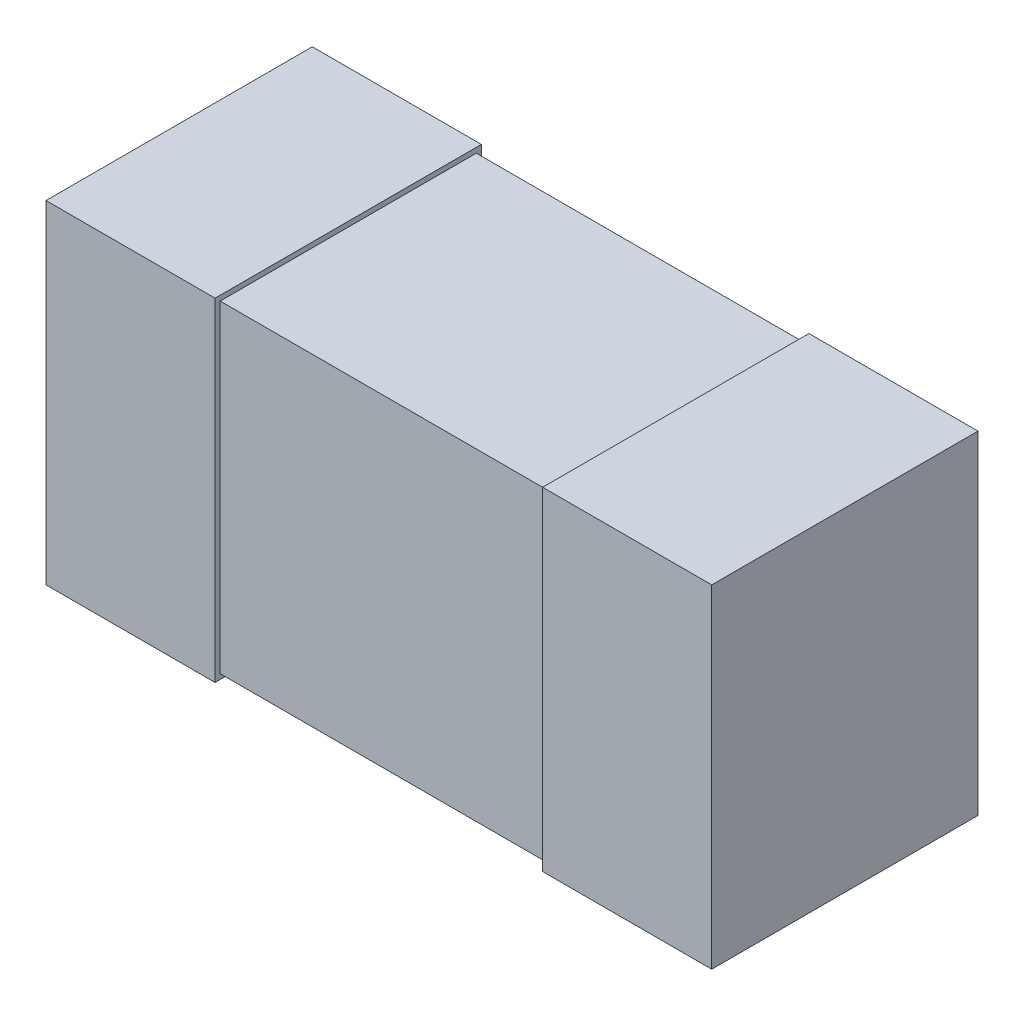
ISO-10303-21;
HEADER;
FILE_DESCRIPTION(('STEP AP214'),'2;1');
FILE_NAME('part.step','',(''),(''),'','','');
FILE_SCHEMA(('AUTOMOTIVE_DESIGN { 1 0 10303 214 1 1 1 1 }'));
ENDSEC;
DATA;
#1=APPLICATION_CONTEXT('core data for automotive mechanical design processes');
#2=APPLICATION_PROTOCOL_DEFINITION('international standard','automotive_design',2000,#1);
#3=PRODUCT_CONTEXT('',#1,'mechanical');
#4=PRODUCT('Part','Part','',(#3));
#5=PRODUCT_RELATED_PRODUCT_CATEGORY('part','',(#4));
#6=PRODUCT_DEFINITION_FORMATION('','',#4);
#7=PRODUCT_DEFINITION_CONTEXT('part definition',#1,'design');
#8=PRODUCT_DEFINITION('design','',#6,#7);
#9=PRODUCT_DEFINITION_SHAPE('','',#8);
#10=(LENGTH_UNIT() NAMED_UNIT(*) SI_UNIT(.MILLI.,.METRE.));
#11=(NAMED_UNIT(*) PLANE_ANGLE_UNIT() SI_UNIT($,.RADIAN.));
#12=(NAMED_UNIT(*) SI_UNIT($,.STERADIAN.) SOLID_ANGLE_UNIT());
#13=UNCERTAINTY_MEASURE_WITH_UNIT(LENGTH_MEASURE(1.E-05),#10,'distance_accuracy_value','');
#14=(GEOMETRIC_REPRESENTATION_CONTEXT(3) GLOBAL_UNCERTAINTY_ASSIGNED_CONTEXT((#13)) GLOBAL_UNIT_ASSIGNED_CONTEXT((#10,
#11,#12)) REPRESENTATION_CONTEXT('',''));
#15=CARTESIAN_POINT('',(0.,0.,0.));
#16=DIRECTION('',(0.,0.,1.));
#17=DIRECTION('',(1.,0.,0.));
#18=AXIS2_PLACEMENT_3D('',#15,#16,#17);
#19=CARTESIAN_POINT('',(0.5,-0.25,0.0762));
#20=DIRECTION('',(1.,0.,0.));
#21=DIRECTION('',(0.,0.,-1.));
#22=AXIS2_PLACEMENT_3D('',#19,#20,#21);
#23=PLANE('',#22);
#24=DIRECTION('',(0.,0.,-1.));
#25=VECTOR('',#24,1.);
#26=CARTESIAN_POINT('',(0.5,-0.25,0.0762));
#27=LINE('',#26,#25);
#28=CARTESIAN_POINT('',(0.5,-0.25,0.0762));
#29=VERTEX_POINT('',#28);
#30=CARTESIAN_POINT('',(0.5,-0.25,0.4762));
#31=VERTEX_POINT('',#30);
#32=EDGE_CURVE('E118',#29,#31,#27,.F.);
#33=ORIENTED_EDGE('',*,*,#32,.F.);
#34=DIRECTION('',(0.,1.,0.));
#35=VECTOR('',#34,1.);
#36=CARTESIAN_POINT('',(0.5,0.,0.0762));
#37=LINE('',#36,#35);
#38=CARTESIAN_POINT('',(0.5,0.25,0.0762));
#39=VERTEX_POINT('',#38);
#40=EDGE_CURVE('E20',#29,#39,#37,.T.);
#41=ORIENTED_EDGE('',*,*,#40,.T.);
#42=DIRECTION('',(0.,0.,1.));
#43=VECTOR('',#42,1.);
#44=CARTESIAN_POINT('',(0.5,0.25,0.0762));
#45=LINE('',#44,#43);
#46=CARTESIAN_POINT('',(0.5,0.25,0.4762));
#47=VERTEX_POINT('',#46);
#48=EDGE_CURVE('E108',#47,#39,#45,.F.);
#49=ORIENTED_EDGE('',*,*,#48,.F.);
#50=DIRECTION('',(0.,1.,0.));
#51=VECTOR('',#50,1.);
#52=CARTESIAN_POINT('',(0.5,0.,0.4762));
#53=LINE('',#52,#51);
#54=EDGE_CURVE('E103',#31,#47,#53,.T.);
#55=ORIENTED_EDGE('',*,*,#54,.F.);
#56=EDGE_LOOP('',(#33,#41,#49,#55));
#57=FACE_BOUND('',#56,.T.);
#58=ADVANCED_FACE('F17',(#57),#23,.T.);
#59=CARTESIAN_POINT('',(-0.5,0.25,0.0762));
#60=DIRECTION('',(-1.,0.,0.));
#61=DIRECTION('',(0.,0.,1.));
#62=AXIS2_PLACEMENT_3D('',#59,#60,#61);
#63=PLANE('',#62);
#64=DIRECTION('',(0.,0.,1.));
#65=VECTOR('',#64,1.);
#66=CARTESIAN_POINT('',(-0.5,0.25,0.0762));
#67=LINE('',#66,#65);
#68=CARTESIAN_POINT('',(-0.5,0.25,0.0762));
#69=VERTEX_POINT('',#68);
#70=CARTESIAN_POINT('',(-0.5,0.25,0.4762));
#71=VERTEX_POINT('',#70);
#72=EDGE_CURVE('E148',#69,#71,#67,.T.);
#73=ORIENTED_EDGE('',*,*,#72,.F.);
#74=DIRECTION('',(0.,1.,0.));
#75=VECTOR('',#74,1.);
#76=CARTESIAN_POINT('',(-0.5,0.,0.0762));
#77=LINE('',#76,#75);
#78=CARTESIAN_POINT('',(-0.5,-0.25,0.0762));
#79=VERTEX_POINT('',#78);
#80=EDGE_CURVE('E134',#69,#79,#77,.F.);
#81=ORIENTED_EDGE('',*,*,#80,.T.);
#82=DIRECTION('',(0.,0.,-1.));
#83=VECTOR('',#82,1.);
#84=CARTESIAN_POINT('',(-0.5,-0.25,0.0762));
#85=LINE('',#84,#83);
#86=CARTESIAN_POINT('',(-0.5,-0.25,0.4762));
#87=VERTEX_POINT('',#86);
#88=EDGE_CURVE('E137',#87,#79,#85,.T.);
#89=ORIENTED_EDGE('',*,*,#88,.F.);
#90=DIRECTION('',(0.,1.,0.));
#91=VECTOR('',#90,1.);
#92=CARTESIAN_POINT('',(-0.5,0.,0.4762));
#93=LINE('',#92,#91);
#94=EDGE_CURVE('E141',#71,#87,#93,.F.);
#95=ORIENTED_EDGE('',*,*,#94,.F.);
#96=EDGE_LOOP('',(#73,#81,#89,#95));
#97=FACE_BOUND('',#96,.T.);
#98=ADVANCED_FACE('F236',(#97),#63,.T.);
#99=CARTESIAN_POINT('',(0.,0.,0.0762));
#100=DIRECTION('',(0.,0.,1.));
#101=DIRECTION('',(1.,0.,0.));
#102=AXIS2_PLACEMENT_3D('',#99,#100,#101);
#103=PLANE('',#102);
#104=ORIENTED_EDGE('',*,*,#40,.F.);
#105=DIRECTION('',(1.,0.,0.));
#106=VECTOR('',#105,1.);
#107=CARTESIAN_POINT('',(-0.5,-0.25,0.0762));
#108=LINE('',#107,#106);
#109=CARTESIAN_POINT('',(0.246,-0.25,0.0762));
#110=VERTEX_POINT('',#109);
#111=EDGE_CURVE('E129',#110,#29,#108,.T.);
#112=ORIENTED_EDGE('',*,*,#111,.F.);
#113=DIRECTION('',(0.,1.,0.));
#114=VECTOR('',#113,1.);
#115=CARTESIAN_POINT('',(0.246,-0.25,0.0762));
#116=LINE('',#115,#114);
#117=CARTESIAN_POINT('',(0.246,0.25,0.0762));
#118=VERTEX_POINT('',#117);
#119=EDGE_CURVE('E124',#110,#118,#116,.T.);
#120=ORIENTED_EDGE('',*,*,#119,.T.);
#121=DIRECTION('',(1.,0.,0.));
#122=VECTOR('',#121,1.);
#123=CARTESIAN_POINT('',(0.5,0.25,0.0762));
#124=LINE('',#123,#122);
#125=EDGE_CURVE('E113',#39,#118,#124,.F.);
#126=ORIENTED_EDGE('',*,*,#125,.F.);
#127=EDGE_LOOP('',(#104,#112,#120,#126));
#128=FACE_BOUND('',#127,.T.);
#129=ADVANCED_FACE('F123',(#128),#103,.F.);
#130=CARTESIAN_POINT('',(0.5,0.25,0.0762));
#131=DIRECTION('',(0.,1.,0.));
#132=DIRECTION('',(0.,0.,1.));
#133=AXIS2_PLACEMENT_3D('',#130,#131,#132);
#134=PLANE('',#133);
#135=ORIENTED_EDGE('',*,*,#125,.T.);
#136=DIRECTION('',(0.,0.,-1.));
#137=VECTOR('',#136,1.);
#138=CARTESIAN_POINT('',(0.246,0.25,0.08382));
#139=LINE('',#138,#137);
#140=CARTESIAN_POINT('',(0.246,0.25,0.4762));
#141=VERTEX_POINT('',#140);
#142=EDGE_CURVE('E156',#118,#141,#139,.F.);
#143=ORIENTED_EDGE('',*,*,#142,.T.);
#144=DIRECTION('',(1.,0.,0.));
#145=VECTOR('',#144,1.);
#146=CARTESIAN_POINT('',(0.,0.25,0.4762));
#147=LINE('',#146,#145);
#148=EDGE_CURVE('E115',#47,#141,#147,.F.);
#149=ORIENTED_EDGE('',*,*,#148,.F.);
#150=ORIENTED_EDGE('',*,*,#48,.T.);
#151=EDGE_LOOP('',(#135,#143,#149,#150));
#152=FACE_BOUND('',#151,.T.);
#153=ADVANCED_FACE('F110',(#152),#134,.T.);
#154=CARTESIAN_POINT('',(0.,0.,0.4762));
#155=DIRECTION('',(0.,0.,1.));
#156=DIRECTION('',(1.,0.,0.));
#157=AXIS2_PLACEMENT_3D('',#154,#155,#156);
#158=PLANE('',#157);
#159=ORIENTED_EDGE('',*,*,#148,.T.);
#160=DIRECTION('',(0.,1.,0.));
#161=VECTOR('',#160,1.);
#162=CARTESIAN_POINT('',(0.246,-0.25,0.4762));
#163=LINE('',#162,#161);
#164=CARTESIAN_POINT('',(0.246,-0.25,0.4762));
#165=VERTEX_POINT('',#164);
#166=EDGE_CURVE('E158',#141,#165,#163,.F.);
#167=ORIENTED_EDGE('',*,*,#166,.T.);
#168=DIRECTION('',(1.,0.,0.));
#169=VECTOR('',#168,1.);
#170=CARTESIAN_POINT('',(-0.5,-0.25,0.4762));
#171=LINE('',#170,#169);
#172=EDGE_CURVE('E132',#31,#165,#171,.F.);
#173=ORIENTED_EDGE('',*,*,#172,.F.);
#174=ORIENTED_EDGE('',*,*,#54,.T.);
#175=EDGE_LOOP('',(#159,#167,#173,#174));
#176=FACE_BOUND('',#175,.T.);
#177=ADVANCED_FACE('F270',(#176),#158,.T.);
#178=CARTESIAN_POINT('',(-0.5,-0.25,0.0762));
#179=DIRECTION('',(0.,-1.,0.));
#180=DIRECTION('',(0.,0.,-1.));
#181=AXIS2_PLACEMENT_3D('',#178,#179,#180);
#182=PLANE('',#181);
#183=ORIENTED_EDGE('',*,*,#172,.T.);
#184=DIRECTION('',(0.,0.,-1.));
#185=VECTOR('',#184,1.);
#186=CARTESIAN_POINT('',(0.246,-0.25,0.08382));
#187=LINE('',#186,#185);
#188=EDGE_CURVE('E161',#165,#110,#187,.T.);
#189=ORIENTED_EDGE('',*,*,#188,.T.);
#190=ORIENTED_EDGE('',*,*,#111,.T.);
#191=ORIENTED_EDGE('',*,*,#32,.T.);
#192=EDGE_LOOP('',(#183,#189,#190,#191));
#193=FACE_BOUND('',#192,.T.);
#194=ADVANCED_FACE('F267',(#193),#182,.T.);
#195=CARTESIAN_POINT('',(0.,0.,0.0762));
#196=DIRECTION('',(0.,0.,1.));
#197=DIRECTION('',(1.,0.,0.));
#198=AXIS2_PLACEMENT_3D('',#195,#196,#197);
#199=PLANE('',#198);
#200=ORIENTED_EDGE('',*,*,#80,.F.);
#201=DIRECTION('',(1.,0.,0.));
#202=VECTOR('',#201,1.);
#203=CARTESIAN_POINT('',(0.5,0.25,0.0762));
#204=LINE('',#203,#202);
#205=CARTESIAN_POINT('',(-0.246,0.25,0.0762));
#206=VERTEX_POINT('',#205);
#207=EDGE_CURVE('E145',#206,#69,#204,.F.);
#208=ORIENTED_EDGE('',*,*,#207,.F.);
#209=DIRECTION('',(0.,1.,0.));
#210=VECTOR('',#209,1.);
#211=CARTESIAN_POINT('',(-0.246,-0.25,0.0762));
#212=LINE('',#211,#210);
#213=CARTESIAN_POINT('',(-0.246,-0.25,0.0762));
#214=VERTEX_POINT('',#213);
#215=EDGE_CURVE('E174',#206,#214,#212,.F.);
#216=ORIENTED_EDGE('',*,*,#215,.T.);
#217=DIRECTION('',(1.,0.,0.));
#218=VECTOR('',#217,1.);
#219=CARTESIAN_POINT('',(-0.5,-0.25,0.0762));
#220=LINE('',#219,#218);
#221=EDGE_CURVE('E139',#79,#214,#220,.T.);
#222=ORIENTED_EDGE('',*,*,#221,.F.);
#223=EDGE_LOOP('',(#200,#208,#216,#222));
#224=FACE_BOUND('',#223,.T.);
#225=ADVANCED_FACE('F228',(#224),#199,.F.);
#226=CARTESIAN_POINT('',(-0.5,-0.25,0.0762));
#227=DIRECTION('',(0.,-1.,0.));
#228=DIRECTION('',(0.,0.,-1.));
#229=AXIS2_PLACEMENT_3D('',#226,#227,#228);
#230=PLANE('',#229);
#231=ORIENTED_EDGE('',*,*,#221,.T.);
#232=DIRECTION('',(0.,0.,1.));
#233=VECTOR('',#232,1.);
#234=CARTESIAN_POINT('',(-0.246,-0.25,0.0762));
#235=LINE('',#234,#233);
#236=CARTESIAN_POINT('',(-0.246,-0.25,0.4762));
#237=VERTEX_POINT('',#236);
#238=EDGE_CURVE('E177',#214,#237,#235,.T.);
#239=ORIENTED_EDGE('',*,*,#238,.T.);
#240=DIRECTION('',(1.,0.,0.));
#241=VECTOR('',#240,1.);
#242=CARTESIAN_POINT('',(0.,-0.25,0.4762));
#243=LINE('',#242,#241);
#244=EDGE_CURVE('E143',#87,#237,#243,.T.);
#245=ORIENTED_EDGE('',*,*,#244,.F.);
#246=ORIENTED_EDGE('',*,*,#88,.T.);
#247=EDGE_LOOP('',(#231,#239,#245,#246));
#248=FACE_BOUND('',#247,.T.);
#249=ADVANCED_FACE('F224',(#248),#230,.T.);
#250=CARTESIAN_POINT('',(0.,0.,0.4762));
#251=DIRECTION('',(0.,0.,1.));
#252=DIRECTION('',(1.,0.,0.));
#253=AXIS2_PLACEMENT_3D('',#250,#251,#252);
#254=PLANE('',#253);
#255=ORIENTED_EDGE('',*,*,#244,.T.);
#256=DIRECTION('',(0.,1.,0.));
#257=VECTOR('',#256,1.);
#258=CARTESIAN_POINT('',(-0.246,-0.25,0.4762));
#259=LINE('',#258,#257);
#260=CARTESIAN_POINT('',(-0.246,0.25,0.4762));
#261=VERTEX_POINT('',#260);
#262=EDGE_CURVE('E180',#237,#261,#259,.T.);
#263=ORIENTED_EDGE('',*,*,#262,.T.);
#264=DIRECTION('',(1.,0.,0.));
#265=VECTOR('',#264,1.);
#266=CARTESIAN_POINT('',(0.5,0.25,0.4762));
#267=LINE('',#266,#265);
#268=EDGE_CURVE('E150',#71,#261,#267,.T.);
#269=ORIENTED_EDGE('',*,*,#268,.F.);
#270=ORIENTED_EDGE('',*,*,#94,.T.);
#271=EDGE_LOOP('',(#255,#263,#269,#270));
#272=FACE_BOUND('',#271,.T.);
#273=ADVANCED_FACE('F234',(#272),#254,.T.);
#274=CARTESIAN_POINT('',(0.5,0.25,0.0762));
#275=DIRECTION('',(0.,1.,0.));
#276=DIRECTION('',(0.,0.,1.));
#277=AXIS2_PLACEMENT_3D('',#274,#275,#276);
#278=PLANE('',#277);
#279=ORIENTED_EDGE('',*,*,#268,.T.);
#280=DIRECTION('',(0.,0.,1.));
#281=VECTOR('',#280,1.);
#282=CARTESIAN_POINT('',(-0.246,0.25,0.0762));
#283=LINE('',#282,#281);
#284=EDGE_CURVE('E183',#261,#206,#283,.F.);
#285=ORIENTED_EDGE('',*,*,#284,.T.);
#286=ORIENTED_EDGE('',*,*,#207,.T.);
#287=ORIENTED_EDGE('',*,*,#72,.T.);
#288=EDGE_LOOP('',(#279,#285,#286,#287));
#289=FACE_BOUND('',#288,.T.);
#290=ADVANCED_FACE('F232',(#289),#278,.T.);
#291=CARTESIAN_POINT('',(-0.246,-0.25,0.08382));
#292=DIRECTION('',(0.,0.,1.));
#293=DIRECTION('',(1.,0.,0.));
#294=AXIS2_PLACEMENT_3D('',#291,#292,#293);
#295=PLANE('',#294);
#296=DIRECTION('',(1.,0.,0.));
#297=VECTOR('',#296,1.);
#298=CARTESIAN_POINT('',(-0.246,0.24238,0.08382));
#299=LINE('',#298,#297);
#300=CARTESIAN_POINT('',(-0.246,0.24238,0.08382));
#301=VERTEX_POINT('',#300);
#302=CARTESIAN_POINT('',(0.246,0.24238,0.08382));
#303=VERTEX_POINT('',#302);
#304=EDGE_CURVE('E152',#301,#303,#299,.T.);
#305=ORIENTED_EDGE('',*,*,#304,.T.);
#306=DIRECTION('',(0.,1.,0.));
#307=VECTOR('',#306,1.);
#308=CARTESIAN_POINT('',(0.246,-0.25,0.08382));
#309=LINE('',#308,#307);
#310=CARTESIAN_POINT('',(0.246,-0.24238,0.08382));
#311=VERTEX_POINT('',#310);
#312=EDGE_CURVE('E164',#303,#311,#309,.F.);
#313=ORIENTED_EDGE('',*,*,#312,.T.);
#314=DIRECTION('',(1.,0.,0.));
#315=VECTOR('',#314,1.);
#316=CARTESIAN_POINT('',(-0.246,-0.24238,0.08382));
#317=LINE('',#316,#315);
#318=CARTESIAN_POINT('',(-0.246,-0.24238,0.08382));
#319=VERTEX_POINT('',#318);
#320=EDGE_CURVE('E172',#311,#319,#317,.F.);
#321=ORIENTED_EDGE('',*,*,#320,.T.);
#322=DIRECTION('',(0.,1.,0.));
#323=VECTOR('',#322,1.);
#324=CARTESIAN_POINT('',(-0.246,-0.25,0.08382));
#325=LINE('',#324,#323);
#326=EDGE_CURVE('E187',#319,#301,#325,.T.);
#327=ORIENTED_EDGE('',*,*,#326,.T.);
#328=EDGE_LOOP('',(#305,#313,#321,#327));
#329=FACE_BOUND('',#328,.T.);
#330=ADVANCED_FACE('F255',(#329),#295,.F.);
#331=CARTESIAN_POINT('',(-0.246,0.24238,0.0762));
#332=DIRECTION('',(0.,-1.,0.));
#333=DIRECTION('',(0.,0.,-1.));
#334=AXIS2_PLACEMENT_3D('',#331,#332,#333);
#335=PLANE('',#334);
#336=DIRECTION('',(-1.,0.,0.));
#337=VECTOR('',#336,1.);
#338=CARTESIAN_POINT('',(-0.246,0.24238,0.46858));
#339=LINE('',#338,#337);
#340=CARTESIAN_POINT('',(-0.246,0.24238,0.46858));
#341=VERTEX_POINT('',#340);
#342=CARTESIAN_POINT('',(0.246,0.24238,0.46858));
#343=VERTEX_POINT('',#342);
#344=EDGE_CURVE('E193',#341,#343,#339,.F.);
#345=ORIENTED_EDGE('',*,*,#344,.T.);
#346=DIRECTION('',(0.,0.,-1.));
#347=VECTOR('',#346,1.);
#348=CARTESIAN_POINT('',(0.246,0.24238,0.08382));
#349=LINE('',#348,#347);
#350=EDGE_CURVE('E166',#343,#303,#349,.T.);
#351=ORIENTED_EDGE('',*,*,#350,.T.);
#352=ORIENTED_EDGE('',*,*,#304,.F.);
#353=DIRECTION('',(0.,0.,1.));
#354=VECTOR('',#353,1.);
#355=CARTESIAN_POINT('',(-0.246,0.24238,0.0762));
#356=LINE('',#355,#354);
#357=EDGE_CURVE('E190',#301,#341,#356,.T.);
#358=ORIENTED_EDGE('',*,*,#357,.T.);
#359=EDGE_LOOP('',(#345,#351,#352,#358));
#360=FACE_BOUND('',#359,.T.);
#361=ADVANCED_FACE('F211',(#360),#335,.F.);
#362=CARTESIAN_POINT('',(0.246,-0.25,0.08382));
#363=DIRECTION('',(1.,0.,0.));
#364=DIRECTION('',(0.,0.,-1.));
#365=AXIS2_PLACEMENT_3D('',#362,#363,#364);
#366=PLANE('',#365);
#367=DIRECTION('',(0.,1.,0.));
#368=VECTOR('',#367,1.);
#369=CARTESIAN_POINT('',(0.246,0.25,0.46858));
#370=LINE('',#369,#368);
#371=CARTESIAN_POINT('',(0.246,-0.24238,0.46858));
#372=VERTEX_POINT('',#371);
#373=EDGE_CURVE('E196',#343,#372,#370,.F.);
#374=ORIENTED_EDGE('',*,*,#373,.T.);
#375=DIRECTION('',(0.,0.,1.));
#376=VECTOR('',#375,1.);
#377=CARTESIAN_POINT('',(0.246,-0.24238,0.4762));
#378=LINE('',#377,#376);
#379=EDGE_CURVE('E169',#372,#311,#378,.F.);
#380=ORIENTED_EDGE('',*,*,#379,.T.);
#381=ORIENTED_EDGE('',*,*,#312,.F.);
#382=ORIENTED_EDGE('',*,*,#350,.F.);
#383=EDGE_LOOP('',(#374,#380,#381,#382));
#384=FACE_BOUND('',#383,.T.);
#385=ORIENTED_EDGE('',*,*,#166,.F.);
#386=ORIENTED_EDGE('',*,*,#142,.F.);
#387=ORIENTED_EDGE('',*,*,#119,.F.);
#388=ORIENTED_EDGE('',*,*,#188,.F.);
#389=EDGE_LOOP('',(#385,#386,#387,#388));
#390=FACE_BOUND('',#389,.T.);
#391=ADVANCED_FACE('F208',(#384,#390),#366,.F.);
#392=CARTESIAN_POINT('',(-0.246,-0.24238,0.4762));
#393=DIRECTION('',(0.,1.,0.));
#394=DIRECTION('',(0.,0.,1.));
#395=AXIS2_PLACEMENT_3D('',#392,#393,#394);
#396=PLANE('',#395);
#397=ORIENTED_EDGE('',*,*,#320,.F.);
#398=ORIENTED_EDGE('',*,*,#379,.F.);
#399=DIRECTION('',(-1.,0.,0.));
#400=VECTOR('',#399,1.);
#401=CARTESIAN_POINT('',(-0.246,-0.24238,0.46858));
#402=LINE('',#401,#400);
#403=CARTESIAN_POINT('',(-0.246,-0.24238,0.46858));
#404=VERTEX_POINT('',#403);
#405=EDGE_CURVE('E26',#372,#404,#402,.T.);
#406=ORIENTED_EDGE('',*,*,#405,.T.);
#407=DIRECTION('',(0.,0.,1.));
#408=VECTOR('',#407,1.);
#409=CARTESIAN_POINT('',(-0.246,-0.24238,0.0762));
#410=LINE('',#409,#408);
#411=EDGE_CURVE('E34',#404,#319,#410,.F.);
#412=ORIENTED_EDGE('',*,*,#411,.T.);
#413=EDGE_LOOP('',(#397,#398,#406,#412));
#414=FACE_BOUND('',#413,.T.);
#415=ADVANCED_FACE('F203',(#414),#396,.F.);
#416=CARTESIAN_POINT('',(-0.246,-0.25,0.0762));
#417=DIRECTION('',(-1.,0.,0.));
#418=DIRECTION('',(0.,0.,1.));
#419=AXIS2_PLACEMENT_3D('',#416,#417,#418);
#420=PLANE('',#419);
#421=ORIENTED_EDGE('',*,*,#357,.F.);
#422=ORIENTED_EDGE('',*,*,#326,.F.);
#423=ORIENTED_EDGE('',*,*,#411,.F.);
#424=DIRECTION('',(0.,1.,0.));
#425=VECTOR('',#424,1.);
#426=CARTESIAN_POINT('',(-0.246,0.25,0.46858));
#427=LINE('',#426,#425);
#428=EDGE_CURVE('E11',#404,#341,#427,.T.);
#429=ORIENTED_EDGE('',*,*,#428,.T.);
#430=EDGE_LOOP('',(#421,#422,#423,#429));
#431=FACE_BOUND('',#430,.T.);
#432=ORIENTED_EDGE('',*,*,#262,.F.);
#433=ORIENTED_EDGE('',*,*,#238,.F.);
#434=ORIENTED_EDGE('',*,*,#215,.F.);
#435=ORIENTED_EDGE('',*,*,#284,.F.);
#436=EDGE_LOOP('',(#432,#433,#434,#435));
#437=FACE_BOUND('',#436,.T.);
#438=ADVANCED_FACE('F213',(#431,#437),#420,.F.);
#439=CARTESIAN_POINT('',(-0.246,0.25,0.46858));
#440=DIRECTION('',(0.,0.,-1.));
#441=DIRECTION('',(-1.,0.,0.));
#442=AXIS2_PLACEMENT_3D('',#439,#440,#441);
#443=PLANE('',#442);
#444=ORIENTED_EDGE('',*,*,#405,.F.);
#445=ORIENTED_EDGE('',*,*,#373,.F.);
#446=ORIENTED_EDGE('',*,*,#344,.F.);
#447=ORIENTED_EDGE('',*,*,#428,.F.);
#448=EDGE_LOOP('',(#444,#445,#446,#447));
#449=FACE_BOUND('',#448,.T.);
#450=ADVANCED_FACE('F206',(#449),#443,.F.);
#451=CLOSED_SHELL('',(#58,#98,#129,#153,#177,#194,#225,#249,#273,#290,#330,#361,#391,#415,#438,#450));
#452=MANIFOLD_SOLID_BREP('B1',#451);
#453=ADVANCED_BREP_SHAPE_REPRESENTATION('',(#18,#452),#14);
#454=SHAPE_DEFINITION_REPRESENTATION(#9,#453);
ENDSEC;
END-ISO-10303-21;
